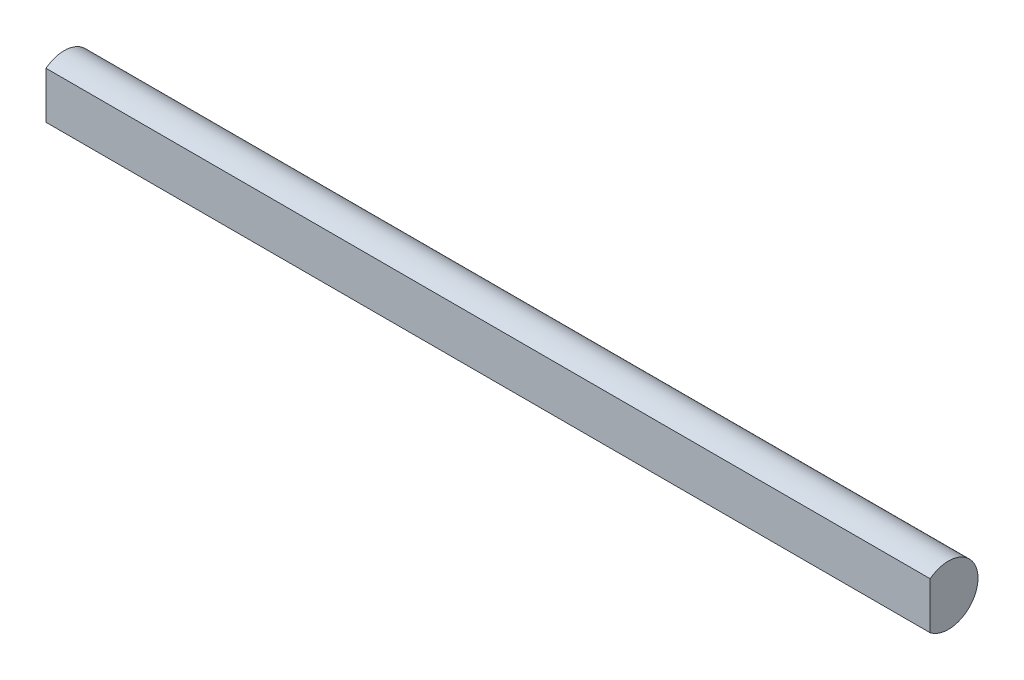
ISO-10303-21;
HEADER;
FILE_DESCRIPTION(('STEP AP214'),'2;1');
FILE_NAME('part.step','',(''),(''),'','','');
FILE_SCHEMA(('AUTOMOTIVE_DESIGN { 1 0 10303 214 1 1 1 1 }'));
ENDSEC;
DATA;
#1=APPLICATION_CONTEXT('core data for automotive mechanical design processes');
#2=APPLICATION_PROTOCOL_DEFINITION('international standard','automotive_design',2000,#1);
#3=PRODUCT_CONTEXT('',#1,'mechanical');
#4=PRODUCT('Part','Part','',(#3));
#5=PRODUCT_RELATED_PRODUCT_CATEGORY('part','',(#4));
#6=PRODUCT_DEFINITION_FORMATION('','',#4);
#7=PRODUCT_DEFINITION_CONTEXT('part definition',#1,'design');
#8=PRODUCT_DEFINITION('design','',#6,#7);
#9=PRODUCT_DEFINITION_SHAPE('','',#8);
#10=(LENGTH_UNIT() NAMED_UNIT(*) SI_UNIT(.MILLI.,.METRE.));
#11=(NAMED_UNIT(*) PLANE_ANGLE_UNIT() SI_UNIT($,.RADIAN.));
#12=(NAMED_UNIT(*) SI_UNIT($,.STERADIAN.) SOLID_ANGLE_UNIT());
#13=UNCERTAINTY_MEASURE_WITH_UNIT(LENGTH_MEASURE(1.E-05),#10,'distance_accuracy_value','');
#14=(GEOMETRIC_REPRESENTATION_CONTEXT(3) GLOBAL_UNCERTAINTY_ASSIGNED_CONTEXT((#13)) GLOBAL_UNIT_ASSIGNED_CONTEXT((#10,
#11,#12)) REPRESENTATION_CONTEXT('',''));
#15=CARTESIAN_POINT('',(0.,0.,0.));
#16=DIRECTION('',(0.,0.,1.));
#17=DIRECTION('',(1.,0.,0.));
#18=AXIS2_PLACEMENT_3D('',#15,#16,#17);
#19=CARTESIAN_POINT('',(85.,0.,0.));
#20=DIRECTION('',(-1.,0.,0.));
#21=DIRECTION('',(0.,0.,1.));
#22=AXIS2_PLACEMENT_3D('',#19,#20,#21);
#23=CYLINDRICAL_SURFACE('',#22,2.85);
#24=CARTESIAN_POINT('',(0.,0.,0.));
#25=DIRECTION('',(1.,0.,0.));
#26=DIRECTION('',(0.,0.,-1.));
#27=AXIS2_PLACEMENT_3D('',#24,#25,#26);
#28=CIRCLE('',#27,2.85);
#29=CARTESIAN_POINT('',(0.,-2.25,1.74928556845359));
#30=VERTEX_POINT('',#29);
#31=CARTESIAN_POINT('',(0.,2.25,1.74928556845359));
#32=VERTEX_POINT('',#31);
#33=EDGE_CURVE('E64',#30,#32,#28,.T.);
#34=ORIENTED_EDGE('',*,*,#33,.T.);
#35=DIRECTION('',(-1.,0.,0.));
#36=VECTOR('',#35,1.);
#37=CARTESIAN_POINT('',(85.,2.25,1.74928556845359));
#38=LINE('',#37,#36);
#39=CARTESIAN_POINT('',(85.,2.25,1.74928556845359));
#40=VERTEX_POINT('',#39);
#41=EDGE_CURVE('E11',#40,#32,#38,.T.);
#42=ORIENTED_EDGE('',*,*,#41,.F.);
#43=CARTESIAN_POINT('',(85.,0.,0.));
#44=DIRECTION('',(1.,0.,0.));
#45=DIRECTION('',(0.,0.,-1.));
#46=AXIS2_PLACEMENT_3D('',#43,#44,#45);
#47=CIRCLE('',#46,2.85);
#48=CARTESIAN_POINT('',(85.,-2.25,1.74928556845359));
#49=VERTEX_POINT('',#48);
#50=EDGE_CURVE('E63',#49,#40,#47,.T.);
#51=ORIENTED_EDGE('',*,*,#50,.F.);
#52=DIRECTION('',(-1.,0.,0.));
#53=VECTOR('',#52,1.);
#54=CARTESIAN_POINT('',(85.,-2.25,1.74928556845359));
#55=LINE('',#54,#53);
#56=EDGE_CURVE('E41',#49,#30,#55,.T.);
#57=ORIENTED_EDGE('',*,*,#56,.T.);
#58=EDGE_LOOP('',(#34,#42,#51,#57));
#59=FACE_BOUND('',#58,.T.);
#60=ADVANCED_FACE('F33',(#59),#23,.T.);
#61=CARTESIAN_POINT('',(85.,2.25,1.74928556845359));
#62=DIRECTION('',(0.,0.,-1.));
#63=DIRECTION('',(-1.,0.,0.));
#64=AXIS2_PLACEMENT_3D('',#61,#62,#63);
#65=PLANE('',#64);
#66=DIRECTION('',(0.,-1.,0.));
#67=VECTOR('',#66,1.);
#68=CARTESIAN_POINT('',(0.,2.25,1.74928556845359));
#69=LINE('',#68,#67);
#70=EDGE_CURVE('E56',#32,#30,#69,.T.);
#71=ORIENTED_EDGE('',*,*,#70,.T.);
#72=ORIENTED_EDGE('',*,*,#56,.F.);
#73=DIRECTION('',(0.,-1.,0.));
#74=VECTOR('',#73,1.);
#75=CARTESIAN_POINT('',(85.,2.25,1.74928556845359));
#76=LINE('',#75,#74);
#77=EDGE_CURVE('E48',#40,#49,#76,.T.);
#78=ORIENTED_EDGE('',*,*,#77,.F.);
#79=ORIENTED_EDGE('',*,*,#41,.T.);
#80=EDGE_LOOP('',(#71,#72,#78,#79));
#81=FACE_BOUND('',#80,.T.);
#82=ADVANCED_FACE('F59',(#81),#65,.F.);
#83=CARTESIAN_POINT('',(85.,0.,0.));
#84=DIRECTION('',(1.,0.,0.));
#85=DIRECTION('',(0.,0.,-1.));
#86=AXIS2_PLACEMENT_3D('',#83,#84,#85);
#87=PLANE('',#86);
#88=ORIENTED_EDGE('',*,*,#50,.T.);
#89=ORIENTED_EDGE('',*,*,#77,.T.);
#90=EDGE_LOOP('',(#88,#89));
#91=FACE_BOUND('',#90,.T.);
#92=ADVANCED_FACE('F71',(#91),#87,.T.);
#93=CARTESIAN_POINT('',(0.,0.,0.));
#94=DIRECTION('',(1.,0.,0.));
#95=DIRECTION('',(0.,0.,-1.));
#96=AXIS2_PLACEMENT_3D('',#93,#94,#95);
#97=PLANE('',#96);
#98=ORIENTED_EDGE('',*,*,#33,.F.);
#99=ORIENTED_EDGE('',*,*,#70,.F.);
#100=EDGE_LOOP('',(#98,#99));
#101=FACE_BOUND('',#100,.T.);
#102=ADVANCED_FACE('F67',(#101),#97,.F.);
#103=CLOSED_SHELL('',(#60,#82,#92,#102));
#104=MANIFOLD_SOLID_BREP('B2',#103);
#105=ADVANCED_BREP_SHAPE_REPRESENTATION('',(#18,#104),#14);
#106=SHAPE_DEFINITION_REPRESENTATION(#9,#105);
ENDSEC;
END-ISO-10303-21;
